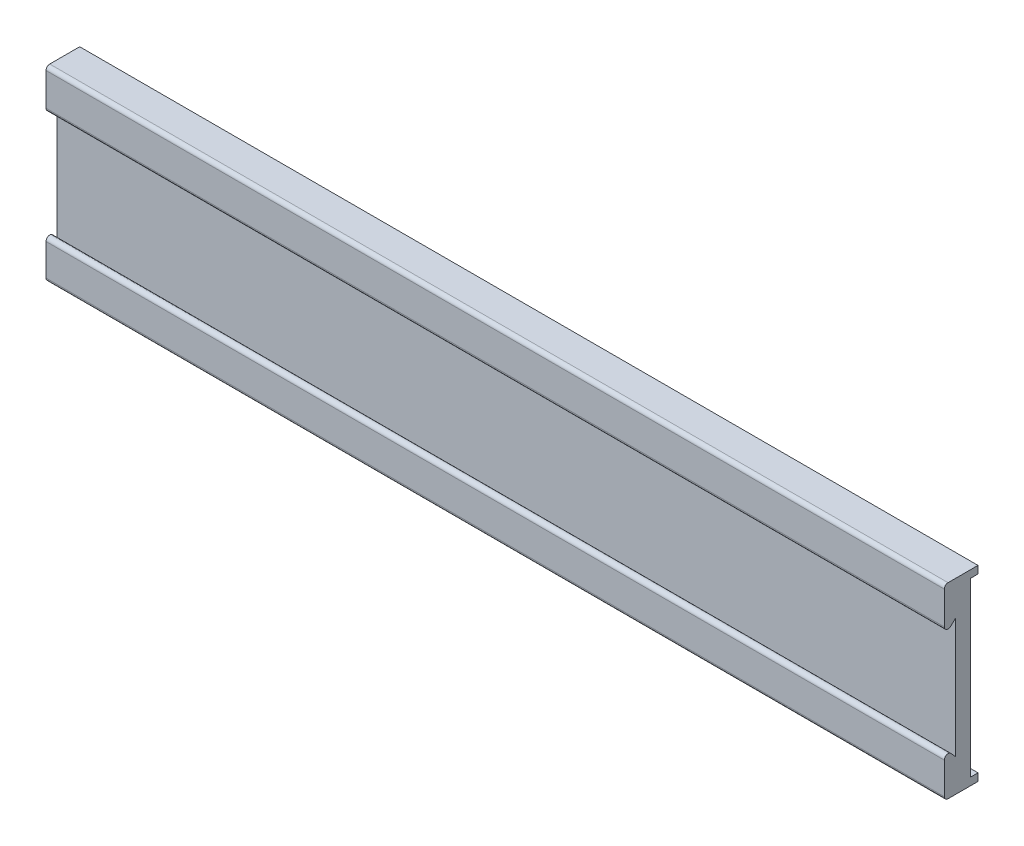
ISO-10303-21;
HEADER;
FILE_DESCRIPTION(('STEP AP214'),'2;1');
FILE_NAME('part.step','',(''),(''),'','','');
FILE_SCHEMA(('AUTOMOTIVE_DESIGN { 1 0 10303 214 1 1 1 1 }'));
ENDSEC;
DATA;
#1=APPLICATION_CONTEXT('core data for automotive mechanical design processes');
#2=APPLICATION_PROTOCOL_DEFINITION('international standard','automotive_design',2000,#1);
#3=PRODUCT_CONTEXT('',#1,'mechanical');
#4=PRODUCT('Part','Part','',(#3));
#5=PRODUCT_RELATED_PRODUCT_CATEGORY('part','',(#4));
#6=PRODUCT_DEFINITION_FORMATION('','',#4);
#7=PRODUCT_DEFINITION_CONTEXT('part definition',#1,'design');
#8=PRODUCT_DEFINITION('design','',#6,#7);
#9=PRODUCT_DEFINITION_SHAPE('','',#8);
#10=(LENGTH_UNIT() NAMED_UNIT(*) SI_UNIT(.MILLI.,.METRE.));
#11=(NAMED_UNIT(*) PLANE_ANGLE_UNIT() SI_UNIT($,.RADIAN.));
#12=(NAMED_UNIT(*) SI_UNIT($,.STERADIAN.) SOLID_ANGLE_UNIT());
#13=UNCERTAINTY_MEASURE_WITH_UNIT(LENGTH_MEASURE(1.E-05),#10,'distance_accuracy_value','');
#14=(GEOMETRIC_REPRESENTATION_CONTEXT(3) GLOBAL_UNCERTAINTY_ASSIGNED_CONTEXT((#13)) GLOBAL_UNIT_ASSIGNED_CONTEXT((#10,
#11,#12)) REPRESENTATION_CONTEXT('',''));
#15=CARTESIAN_POINT('',(0.,0.,0.));
#16=DIRECTION('',(0.,0.,1.));
#17=DIRECTION('',(1.,0.,0.));
#18=AXIS2_PLACEMENT_3D('',#15,#16,#17);
#19=CARTESIAN_POINT('',(0.,0.,3.5));
#20=DIRECTION('',(-1.,0.,0.));
#21=DIRECTION('',(0.,0.,1.));
#22=AXIS2_PLACEMENT_3D('',#19,#20,#21);
#23=PLANE('',#22);
#24=DIRECTION('',(0.,0.,-1.));
#25=VECTOR('',#24,1.);
#26=CARTESIAN_POINT('',(0.,0.,3.5));
#27=LINE('',#26,#25);
#28=CARTESIAN_POINT('',(0.,0.,3.));
#29=VERTEX_POINT('',#28);
#30=CARTESIAN_POINT('',(0.,0.,-1.));
#31=VERTEX_POINT('',#30);
#32=EDGE_CURVE('E274',#29,#31,#27,.T.);
#33=ORIENTED_EDGE('',*,*,#32,.F.);
#34=CARTESIAN_POINT('',(0.,0.5,3.));
#35=DIRECTION('',(-1.,0.,0.));
#36=DIRECTION('',(0.,0.,1.));
#37=AXIS2_PLACEMENT_3D('',#34,#35,#36);
#38=CIRCLE('',#37,0.5);
#39=CARTESIAN_POINT('',(0.,0.5,3.5));
#40=VERTEX_POINT('',#39);
#41=EDGE_CURVE('E318',#29,#40,#38,.T.);
#42=ORIENTED_EDGE('',*,*,#41,.T.);
#43=DIRECTION('',(0.,1.,0.));
#44=VECTOR('',#43,1.);
#45=CARTESIAN_POINT('',(0.,0.,3.5));
#46=LINE('',#45,#44);
#47=CARTESIAN_POINT('',(0.,4.72078886584155,3.5));
#48=VERTEX_POINT('',#47);
#49=EDGE_CURVE('E252',#40,#48,#46,.T.);
#50=ORIENTED_EDGE('',*,*,#49,.T.);
#51=CARTESIAN_POINT('',(0.,4.72078886584155,3.));
#52=DIRECTION('',(-1.,0.,0.));
#53=DIRECTION('',(0.,0.,1.));
#54=AXIS2_PLACEMENT_3D('',#51,#52,#53);
#55=CIRCLE('',#54,0.5);
#56=CARTESIAN_POINT('',(0.,5.05985373367055,2.63252889174236));
#57=VERTEX_POINT('',#56);
#58=EDGE_CURVE('E169',#48,#57,#55,.T.);
#59=ORIENTED_EDGE('',*,*,#58,.T.);
#60=DIRECTION('',(0.,-0.734942216515289,-0.678129735658003));
#61=VECTOR('',#60,1.);
#62=CARTESIAN_POINT('',(0.,1.01480803176859,-1.0998268103991));
#63=LINE('',#62,#61);
#64=CARTESIAN_POINT('',(0.,4.37433271717065,2.));
#65=VERTEX_POINT('',#64);
#66=EDGE_CURVE('E163',#57,#65,#63,.T.);
#67=ORIENTED_EDGE('',*,*,#66,.T.);
#68=DIRECTION('',(0.,-1.,0.));
#69=VECTOR('',#68,1.);
#70=CARTESIAN_POINT('',(0.,0.,2.));
#71=LINE('',#70,#69);
#72=CARTESIAN_POINT('',(0.,20.3840470456439,2.));
#73=VERTEX_POINT('',#72);
#74=EDGE_CURVE('E167',#73,#65,#71,.T.);
#75=ORIENTED_EDGE('',*,*,#74,.F.);
#76=DIRECTION('',(0.,0.678129735658003,-0.73494221651529));
#77=VECTOR('',#76,1.);
#78=CARTESIAN_POINT('',(0.,12.0070127692447,11.0788470335216));
#79=LINE('',#78,#77);
#80=CARTESIAN_POINT('',(0.,19.7742035009482,2.660935132171));
#81=VERTEX_POINT('',#80);
#82=EDGE_CURVE('E175',#81,#73,#79,.T.);
#83=ORIENTED_EDGE('',*,*,#82,.F.);
#84=CARTESIAN_POINT('',(0.,20.1416746092059,3.));
#85=DIRECTION('',(-1.,0.,0.));
#86=DIRECTION('',(0.,0.,1.));
#87=AXIS2_PLACEMENT_3D('',#84,#85,#86);
#88=CIRCLE('',#87,0.5);
#89=CARTESIAN_POINT('',(0.,20.1416746092059,3.5));
#90=VERTEX_POINT('',#89);
#91=EDGE_CURVE('E293',#81,#90,#88,.T.);
#92=ORIENTED_EDGE('',*,*,#91,.T.);
#93=CARTESIAN_POINT('',(0.,24.5,3.5));
#94=VERTEX_POINT('',#93);
#95=EDGE_CURVE('E256',#90,#94,#46,.T.);
#96=ORIENTED_EDGE('',*,*,#95,.T.);
#97=CARTESIAN_POINT('',(0.,24.5,3.));
#98=DIRECTION('',(-1.,0.,0.));
#99=DIRECTION('',(0.,0.,1.));
#100=AXIS2_PLACEMENT_3D('',#97,#98,#99);
#101=CIRCLE('',#100,0.5);
#102=CARTESIAN_POINT('',(0.,25.,3.));
#103=VERTEX_POINT('',#102);
#104=EDGE_CURVE('E66',#94,#103,#101,.T.);
#105=ORIENTED_EDGE('',*,*,#104,.T.);
#106=DIRECTION('',(0.,0.,-1.));
#107=VECTOR('',#106,1.);
#108=CARTESIAN_POINT('',(0.,25.,3.5));
#109=LINE('',#108,#107);
#110=CARTESIAN_POINT('',(0.,25.,-1.));
#111=VERTEX_POINT('',#110);
#112=EDGE_CURVE('E260',#103,#111,#109,.T.);
#113=ORIENTED_EDGE('',*,*,#112,.T.);
#114=DIRECTION('',(0.,1.,0.));
#115=VECTOR('',#114,1.);
#116=CARTESIAN_POINT('',(0.,0.,-1.));
#117=LINE('',#116,#115);
#118=CARTESIAN_POINT('',(0.,24.,-1.));
#119=VERTEX_POINT('',#118);
#120=EDGE_CURVE('E236',#119,#111,#117,.T.);
#121=ORIENTED_EDGE('',*,*,#120,.F.);
#122=DIRECTION('',(0.,0.,1.));
#123=VECTOR('',#122,1.);
#124=CARTESIAN_POINT('',(0.,24.,-1.));
#125=LINE('',#124,#123);
#126=CARTESIAN_POINT('',(0.,24.,0.));
#127=VERTEX_POINT('',#126);
#128=EDGE_CURVE('E244',#119,#127,#125,.T.);
#129=ORIENTED_EDGE('',*,*,#128,.T.);
#130=DIRECTION('',(0.,1.,0.));
#131=VECTOR('',#130,1.);
#132=CARTESIAN_POINT('',(0.,0.,0.));
#133=LINE('',#132,#131);
#134=CARTESIAN_POINT('',(0.,1.,0.));
#135=VERTEX_POINT('',#134);
#136=EDGE_CURVE('E248',#135,#127,#133,.T.);
#137=ORIENTED_EDGE('',*,*,#136,.F.);
#138=DIRECTION('',(0.,0.,1.));
#139=VECTOR('',#138,1.);
#140=CARTESIAN_POINT('',(0.,1.,-1.));
#141=LINE('',#140,#139);
#142=CARTESIAN_POINT('',(0.,1.,-1.));
#143=VERTEX_POINT('',#142);
#144=EDGE_CURVE('E212',#143,#135,#141,.T.);
#145=ORIENTED_EDGE('',*,*,#144,.F.);
#146=DIRECTION('',(0.,1.,0.));
#147=VECTOR('',#146,1.);
#148=CARTESIAN_POINT('',(0.,0.,-1.));
#149=LINE('',#148,#147);
#150=EDGE_CURVE('E201',#31,#143,#149,.T.);
#151=ORIENTED_EDGE('',*,*,#150,.F.);
#152=EDGE_LOOP('',(#33,#42,#50,#59,#67,#75,#83,#92,#96,#105,#113,#121,#129,#137,#145,#151));
#153=FACE_BOUND('',#152,.T.);
#154=ADVANCED_FACE('F50',(#153),#23,.T.);
#155=CARTESIAN_POINT('',(120.,0.,3.5));
#156=DIRECTION('',(-1.,0.,0.));
#157=DIRECTION('',(0.,0.,1.));
#158=AXIS2_PLACEMENT_3D('',#155,#156,#157);
#159=PLANE('',#158);
#160=DIRECTION('',(0.,1.,0.));
#161=VECTOR('',#160,1.);
#162=CARTESIAN_POINT('',(120.,0.,3.5));
#163=LINE('',#162,#161);
#164=CARTESIAN_POINT('',(120.,0.5,3.5));
#165=VERTEX_POINT('',#164);
#166=CARTESIAN_POINT('',(120.,4.72078886584155,3.5));
#167=VERTEX_POINT('',#166);
#168=EDGE_CURVE('E257',#165,#167,#163,.T.);
#169=ORIENTED_EDGE('',*,*,#168,.F.);
#170=CARTESIAN_POINT('',(120.,0.5,3.));
#171=DIRECTION('',(-1.,0.,0.));
#172=DIRECTION('',(0.,0.,1.));
#173=AXIS2_PLACEMENT_3D('',#170,#171,#172);
#174=CIRCLE('',#173,0.5);
#175=CARTESIAN_POINT('',(120.,0.,3.));
#176=VERTEX_POINT('',#175);
#177=EDGE_CURVE('E310',#165,#176,#174,.F.);
#178=ORIENTED_EDGE('',*,*,#177,.T.);
#179=DIRECTION('',(0.,0.,-1.));
#180=VECTOR('',#179,1.);
#181=CARTESIAN_POINT('',(120.,0.,3.5));
#182=LINE('',#181,#180);
#183=CARTESIAN_POINT('',(120.,0.,-1.));
#184=VERTEX_POINT('',#183);
#185=EDGE_CURVE('E271',#176,#184,#182,.T.);
#186=ORIENTED_EDGE('',*,*,#185,.T.);
#187=DIRECTION('',(0.,1.,0.));
#188=VECTOR('',#187,1.);
#189=CARTESIAN_POINT('',(120.,0.,-1.));
#190=LINE('',#189,#188);
#191=CARTESIAN_POINT('',(120.,1.,-1.));
#192=VERTEX_POINT('',#191);
#193=EDGE_CURVE('E208',#184,#192,#190,.T.);
#194=ORIENTED_EDGE('',*,*,#193,.T.);
#195=DIRECTION('',(0.,0.,1.));
#196=VECTOR('',#195,1.);
#197=CARTESIAN_POINT('',(120.,1.,-1.));
#198=LINE('',#197,#196);
#199=CARTESIAN_POINT('',(120.,1.,0.));
#200=VERTEX_POINT('',#199);
#201=EDGE_CURVE('E216',#192,#200,#198,.T.);
#202=ORIENTED_EDGE('',*,*,#201,.T.);
#203=DIRECTION('',(0.,1.,0.));
#204=VECTOR('',#203,1.);
#205=CARTESIAN_POINT('',(120.,0.,0.));
#206=LINE('',#205,#204);
#207=CARTESIAN_POINT('',(120.,24.,0.));
#208=VERTEX_POINT('',#207);
#209=EDGE_CURVE('E263',#200,#208,#206,.T.);
#210=ORIENTED_EDGE('',*,*,#209,.T.);
#211=DIRECTION('',(0.,0.,1.));
#212=VECTOR('',#211,1.);
#213=CARTESIAN_POINT('',(120.,24.,-1.));
#214=LINE('',#213,#212);
#215=CARTESIAN_POINT('',(120.,24.,-1.));
#216=VERTEX_POINT('',#215);
#217=EDGE_CURVE('E240',#216,#208,#214,.T.);
#218=ORIENTED_EDGE('',*,*,#217,.F.);
#219=DIRECTION('',(0.,1.,0.));
#220=VECTOR('',#219,1.);
#221=CARTESIAN_POINT('',(120.,0.,-1.));
#222=LINE('',#221,#220);
#223=CARTESIAN_POINT('',(120.,25.,-1.));
#224=VERTEX_POINT('',#223);
#225=EDGE_CURVE('E228',#216,#224,#222,.T.);
#226=ORIENTED_EDGE('',*,*,#225,.T.);
#227=DIRECTION('',(0.,0.,-1.));
#228=VECTOR('',#227,1.);
#229=CARTESIAN_POINT('',(120.,25.,3.5));
#230=LINE('',#229,#228);
#231=CARTESIAN_POINT('',(120.,25.,3.));
#232=VERTEX_POINT('',#231);
#233=EDGE_CURVE('E268',#232,#224,#230,.T.);
#234=ORIENTED_EDGE('',*,*,#233,.F.);
#235=CARTESIAN_POINT('',(120.,24.5,3.));
#236=DIRECTION('',(-1.,0.,0.));
#237=DIRECTION('',(0.,0.,1.));
#238=AXIS2_PLACEMENT_3D('',#235,#236,#237);
#239=CIRCLE('',#238,0.5);
#240=CARTESIAN_POINT('',(120.,24.5,3.5));
#241=VERTEX_POINT('',#240);
#242=EDGE_CURVE('E307',#232,#241,#239,.F.);
#243=ORIENTED_EDGE('',*,*,#242,.T.);
#244=CARTESIAN_POINT('',(120.,20.1416746092059,3.5));
#245=VERTEX_POINT('',#244);
#246=EDGE_CURVE('E255',#245,#241,#163,.T.);
#247=ORIENTED_EDGE('',*,*,#246,.F.);
#248=CARTESIAN_POINT('',(120.,20.1416746092059,3.));
#249=DIRECTION('',(-1.,0.,0.));
#250=DIRECTION('',(0.,0.,1.));
#251=AXIS2_PLACEMENT_3D('',#248,#249,#250);
#252=CIRCLE('',#251,0.5);
#253=CARTESIAN_POINT('',(120.,19.7742035009482,2.660935132171));
#254=VERTEX_POINT('',#253);
#255=EDGE_CURVE('E285',#245,#254,#252,.F.);
#256=ORIENTED_EDGE('',*,*,#255,.T.);
#257=DIRECTION('',(0.,0.678129735658003,-0.73494221651529));
#258=VECTOR('',#257,1.);
#259=CARTESIAN_POINT('',(120.,12.0070127692447,11.0788470335216));
#260=LINE('',#259,#258);
#261=CARTESIAN_POINT('',(120.,20.3840470456439,2.));
#262=VERTEX_POINT('',#261);
#263=EDGE_CURVE('E544',#254,#262,#260,.T.);
#264=ORIENTED_EDGE('',*,*,#263,.T.);
#265=DIRECTION('',(0.,-1.,0.));
#266=VECTOR('',#265,1.);
#267=CARTESIAN_POINT('',(120.,0.,2.));
#268=LINE('',#267,#266);
#269=CARTESIAN_POINT('',(120.,4.37433271717065,2.));
#270=VERTEX_POINT('',#269);
#271=EDGE_CURVE('E548',#262,#270,#268,.T.);
#272=ORIENTED_EDGE('',*,*,#271,.T.);
#273=DIRECTION('',(0.,-0.734942216515289,-0.678129735658003));
#274=VECTOR('',#273,1.);
#275=CARTESIAN_POINT('',(120.,1.01480803176859,-1.0998268103991));
#276=LINE('',#275,#274);
#277=CARTESIAN_POINT('',(120.,5.05985373367055,2.63252889174236));
#278=VERTEX_POINT('',#277);
#279=EDGE_CURVE('E190',#278,#270,#276,.T.);
#280=ORIENTED_EDGE('',*,*,#279,.F.);
#281=CARTESIAN_POINT('',(120.,4.72078886584155,3.));
#282=DIRECTION('',(-1.,0.,0.));
#283=DIRECTION('',(0.,0.,1.));
#284=AXIS2_PLACEMENT_3D('',#281,#282,#283);
#285=CIRCLE('',#284,0.5);
#286=EDGE_CURVE('E281',#278,#167,#285,.F.);
#287=ORIENTED_EDGE('',*,*,#286,.T.);
#288=EDGE_LOOP('',(#169,#178,#186,#194,#202,#210,#218,#226,#234,#243,#247,#256,#264,#272,#280,#287));
#289=FACE_BOUND('',#288,.T.);
#290=ADVANCED_FACE('F330',(#289),#159,.F.);
#291=CARTESIAN_POINT('',(0.,0.,3.5));
#292=DIRECTION('',(0.,0.,1.));
#293=DIRECTION('',(1.,0.,0.));
#294=AXIS2_PLACEMENT_3D('',#291,#292,#293);
#295=PLANE('',#294);
#296=ORIENTED_EDGE('',*,*,#246,.T.);
#297=DIRECTION('',(1.,0.,0.));
#298=VECTOR('',#297,1.);
#299=CARTESIAN_POINT('',(0.,24.5,3.5));
#300=LINE('',#299,#298);
#301=EDGE_CURVE('E13',#241,#94,#300,.F.);
#302=ORIENTED_EDGE('',*,*,#301,.T.);
#303=ORIENTED_EDGE('',*,*,#95,.F.);
#304=DIRECTION('',(1.,0.,0.));
#305=VECTOR('',#304,1.);
#306=CARTESIAN_POINT('',(0.,20.1416746092059,3.5));
#307=LINE('',#306,#305);
#308=EDGE_CURVE('E277',#90,#245,#307,.T.);
#309=ORIENTED_EDGE('',*,*,#308,.T.);
#310=EDGE_LOOP('',(#296,#302,#303,#309));
#311=FACE_BOUND('',#310,.T.);
#312=ADVANCED_FACE('F380',(#311),#295,.T.);
#313=CARTESIAN_POINT('',(0.,0.,0.));
#314=DIRECTION('',(0.,0.,1.));
#315=DIRECTION('',(1.,0.,0.));
#316=AXIS2_PLACEMENT_3D('',#313,#314,#315);
#317=PLANE('',#316);
#318=DIRECTION('',(1.,0.,0.));
#319=VECTOR('',#318,1.);
#320=CARTESIAN_POINT('',(0.,1.,0.));
#321=LINE('',#320,#319);
#322=EDGE_CURVE('E194',#135,#200,#321,.T.);
#323=ORIENTED_EDGE('',*,*,#322,.F.);
#324=ORIENTED_EDGE('',*,*,#136,.T.);
#325=DIRECTION('',(1.,0.,0.));
#326=VECTOR('',#325,1.);
#327=CARTESIAN_POINT('',(0.,24.,0.));
#328=LINE('',#327,#326);
#329=EDGE_CURVE('E220',#127,#208,#328,.T.);
#330=ORIENTED_EDGE('',*,*,#329,.T.);
#331=ORIENTED_EDGE('',*,*,#209,.F.);
#332=EDGE_LOOP('',(#323,#324,#330,#331));
#333=FACE_BOUND('',#332,.T.);
#334=ADVANCED_FACE('F345',(#333),#317,.F.);
#335=CARTESIAN_POINT('',(0.,0.,3.5));
#336=DIRECTION('',(0.,1.,0.));
#337=DIRECTION('',(0.,0.,1.));
#338=AXIS2_PLACEMENT_3D('',#335,#336,#337);
#339=PLANE('',#338);
#340=ORIENTED_EDGE('',*,*,#185,.F.);
#341=DIRECTION('',(1.,0.,0.));
#342=VECTOR('',#341,1.);
#343=CARTESIAN_POINT('',(0.,0.,3.));
#344=LINE('',#343,#342);
#345=EDGE_CURVE('E313',#176,#29,#344,.F.);
#346=ORIENTED_EDGE('',*,*,#345,.T.);
#347=ORIENTED_EDGE('',*,*,#32,.T.);
#348=DIRECTION('',(1.,0.,0.));
#349=VECTOR('',#348,1.);
#350=CARTESIAN_POINT('',(0.,0.,-1.));
#351=LINE('',#350,#349);
#352=EDGE_CURVE('E204',#31,#184,#351,.T.);
#353=ORIENTED_EDGE('',*,*,#352,.T.);
#354=EDGE_LOOP('',(#340,#346,#347,#353));
#355=FACE_BOUND('',#354,.T.);
#356=ADVANCED_FACE('F383',(#355),#339,.F.);
#357=CARTESIAN_POINT('',(0.,25.,3.5));
#358=DIRECTION('',(0.,1.,0.));
#359=DIRECTION('',(0.,0.,1.));
#360=AXIS2_PLACEMENT_3D('',#357,#358,#359);
#361=PLANE('',#360);
#362=ORIENTED_EDGE('',*,*,#112,.F.);
#363=DIRECTION('',(1.,0.,0.));
#364=VECTOR('',#363,1.);
#365=CARTESIAN_POINT('',(0.,25.,3.));
#366=LINE('',#365,#364);
#367=EDGE_CURVE('E59',#103,#232,#366,.T.);
#368=ORIENTED_EDGE('',*,*,#367,.T.);
#369=ORIENTED_EDGE('',*,*,#233,.T.);
#370=DIRECTION('',(1.,0.,0.));
#371=VECTOR('',#370,1.);
#372=CARTESIAN_POINT('',(0.,25.,-1.));
#373=LINE('',#372,#371);
#374=EDGE_CURVE('E232',#111,#224,#373,.T.);
#375=ORIENTED_EDGE('',*,*,#374,.F.);
#376=EDGE_LOOP('',(#362,#368,#369,#375));
#377=FACE_BOUND('',#376,.T.);
#378=ADVANCED_FACE('F325',(#377),#361,.T.);
#379=ORIENTED_EDGE('',*,*,#49,.F.);
#380=DIRECTION('',(1.,0.,0.));
#381=VECTOR('',#380,1.);
#382=CARTESIAN_POINT('',(120.,0.5,3.5));
#383=LINE('',#382,#381);
#384=EDGE_CURVE('E303',#40,#165,#383,.T.);
#385=ORIENTED_EDGE('',*,*,#384,.T.);
#386=ORIENTED_EDGE('',*,*,#168,.T.);
#387=DIRECTION('',(1.,0.,0.));
#388=VECTOR('',#387,1.);
#389=CARTESIAN_POINT('',(0.,4.72078886584155,3.5));
#390=LINE('',#389,#388);
#391=EDGE_CURVE('E299',#167,#48,#390,.F.);
#392=ORIENTED_EDGE('',*,*,#391,.T.);
#393=EDGE_LOOP('',(#379,#385,#386,#392));
#394=FACE_BOUND('',#393,.T.);
#395=ADVANCED_FACE('F361',(#394),#295,.T.);
#396=CARTESIAN_POINT('',(0.,24.,-1.));
#397=DIRECTION('',(0.,-1.,0.));
#398=DIRECTION('',(0.,0.,-1.));
#399=AXIS2_PLACEMENT_3D('',#396,#397,#398);
#400=PLANE('',#399);
#401=ORIENTED_EDGE('',*,*,#329,.F.);
#402=ORIENTED_EDGE('',*,*,#128,.F.);
#403=DIRECTION('',(1.,0.,0.));
#404=VECTOR('',#403,1.);
#405=CARTESIAN_POINT('',(0.,24.,-1.));
#406=LINE('',#405,#404);
#407=EDGE_CURVE('E224',#119,#216,#406,.T.);
#408=ORIENTED_EDGE('',*,*,#407,.T.);
#409=ORIENTED_EDGE('',*,*,#217,.T.);
#410=EDGE_LOOP('',(#401,#402,#408,#409));
#411=FACE_BOUND('',#410,.T.);
#412=ADVANCED_FACE('F338',(#411),#400,.T.);
#413=CARTESIAN_POINT('',(0.,0.,-1.));
#414=DIRECTION('',(0.,0.,1.));
#415=DIRECTION('',(1.,0.,0.));
#416=AXIS2_PLACEMENT_3D('',#413,#414,#415);
#417=PLANE('',#416);
#418=ORIENTED_EDGE('',*,*,#407,.F.);
#419=ORIENTED_EDGE('',*,*,#120,.T.);
#420=ORIENTED_EDGE('',*,*,#374,.T.);
#421=ORIENTED_EDGE('',*,*,#225,.F.);
#422=EDGE_LOOP('',(#418,#419,#420,#421));
#423=FACE_BOUND('',#422,.T.);
#424=ADVANCED_FACE('F335',(#423),#417,.F.);
#425=CARTESIAN_POINT('',(0.,1.,-1.));
#426=DIRECTION('',(0.,-1.,0.));
#427=DIRECTION('',(0.,0.,-1.));
#428=AXIS2_PLACEMENT_3D('',#425,#426,#427);
#429=PLANE('',#428);
#430=ORIENTED_EDGE('',*,*,#322,.T.);
#431=ORIENTED_EDGE('',*,*,#201,.F.);
#432=DIRECTION('',(1.,0.,0.));
#433=VECTOR('',#432,1.);
#434=CARTESIAN_POINT('',(0.,1.,-1.));
#435=LINE('',#434,#433);
#436=EDGE_CURVE('E198',#143,#192,#435,.T.);
#437=ORIENTED_EDGE('',*,*,#436,.F.);
#438=ORIENTED_EDGE('',*,*,#144,.T.);
#439=EDGE_LOOP('',(#430,#431,#437,#438));
#440=FACE_BOUND('',#439,.T.);
#441=ADVANCED_FACE('F348',(#440),#429,.F.);
#442=CARTESIAN_POINT('',(0.,0.,-1.));
#443=DIRECTION('',(0.,0.,1.));
#444=DIRECTION('',(1.,0.,0.));
#445=AXIS2_PLACEMENT_3D('',#442,#443,#444);
#446=PLANE('',#445);
#447=ORIENTED_EDGE('',*,*,#436,.T.);
#448=ORIENTED_EDGE('',*,*,#193,.F.);
#449=ORIENTED_EDGE('',*,*,#352,.F.);
#450=ORIENTED_EDGE('',*,*,#150,.T.);
#451=EDGE_LOOP('',(#447,#448,#449,#450));
#452=FACE_BOUND('',#451,.T.);
#453=ADVANCED_FACE('F351',(#452),#446,.F.);
#454=CARTESIAN_POINT('',(0.,12.0070127692447,11.0788470335216));
#455=DIRECTION('',(0.,-0.73494221651529,-0.678129735658003));
#456=DIRECTION('',(0.,0.678129735658003,-0.73494221651529));
#457=AXIS2_PLACEMENT_3D('',#454,#455,#456);
#458=PLANE('',#457);
#459=ORIENTED_EDGE('',*,*,#263,.F.);
#460=DIRECTION('',(1.,0.,0.));
#461=VECTOR('',#460,1.);
#462=CARTESIAN_POINT('',(0.,19.7742035009482,2.660935132171));
#463=LINE('',#462,#461);
#464=EDGE_CURVE('E288',#254,#81,#463,.F.);
#465=ORIENTED_EDGE('',*,*,#464,.T.);
#466=ORIENTED_EDGE('',*,*,#82,.T.);
#467=DIRECTION('',(1.,0.,0.));
#468=VECTOR('',#467,1.);
#469=CARTESIAN_POINT('',(0.,20.3840470456439,2.));
#470=LINE('',#469,#468);
#471=EDGE_CURVE('E185',#73,#262,#470,.T.);
#472=ORIENTED_EDGE('',*,*,#471,.T.);
#473=EDGE_LOOP('',(#459,#465,#466,#472));
#474=FACE_BOUND('',#473,.T.);
#475=ADVANCED_FACE('F400',(#474),#458,.T.);
#476=CARTESIAN_POINT('',(0.,0.,2.));
#477=DIRECTION('',(0.,0.,1.));
#478=DIRECTION('',(1.,0.,0.));
#479=AXIS2_PLACEMENT_3D('',#476,#477,#478);
#480=PLANE('',#479);
#481=ORIENTED_EDGE('',*,*,#271,.F.);
#482=ORIENTED_EDGE('',*,*,#471,.F.);
#483=ORIENTED_EDGE('',*,*,#74,.T.);
#484=DIRECTION('',(1.,0.,0.));
#485=VECTOR('',#484,1.);
#486=CARTESIAN_POINT('',(0.,4.37433271717065,2.));
#487=LINE('',#486,#485);
#488=EDGE_CURVE('E182',#65,#270,#487,.T.);
#489=ORIENTED_EDGE('',*,*,#488,.T.);
#490=EDGE_LOOP('',(#481,#482,#483,#489));
#491=FACE_BOUND('',#490,.T.);
#492=ADVANCED_FACE('F181',(#491),#480,.T.);
#493=CARTESIAN_POINT('',(0.,1.01480803176859,-1.0998268103991));
#494=DIRECTION('',(0.,-0.678129735658003,0.734942216515289));
#495=DIRECTION('',(0.,-0.734942216515289,-0.678129735658003));
#496=AXIS2_PLACEMENT_3D('',#493,#494,#495);
#497=PLANE('',#496);
#498=ORIENTED_EDGE('',*,*,#66,.F.);
#499=DIRECTION('',(1.,0.,0.));
#500=VECTOR('',#499,1.);
#501=CARTESIAN_POINT('',(120.,5.05985373367055,2.63252889174236));
#502=LINE('',#501,#500);
#503=EDGE_CURVE('E296',#57,#278,#502,.T.);
#504=ORIENTED_EDGE('',*,*,#503,.T.);
#505=ORIENTED_EDGE('',*,*,#279,.T.);
#506=ORIENTED_EDGE('',*,*,#488,.F.);
#507=EDGE_LOOP('',(#498,#504,#505,#506));
#508=FACE_BOUND('',#507,.T.);
#509=ADVANCED_FACE('F188',(#508),#497,.F.);
#510=CARTESIAN_POINT('',(0.,20.1416746092059,3.));
#511=DIRECTION('',(1.,0.,0.));
#512=DIRECTION('',(0.,0.,-1.));
#513=AXIS2_PLACEMENT_3D('',#510,#511,#512);
#514=CYLINDRICAL_SURFACE('',#513,0.5);
#515=ORIENTED_EDGE('',*,*,#91,.F.);
#516=ORIENTED_EDGE('',*,*,#464,.F.);
#517=ORIENTED_EDGE('',*,*,#255,.F.);
#518=ORIENTED_EDGE('',*,*,#308,.F.);
#519=EDGE_LOOP('',(#515,#516,#517,#518));
#520=FACE_BOUND('',#519,.T.);
#521=ADVANCED_FACE('F367',(#520),#514,.T.);
#522=CARTESIAN_POINT('',(0.,4.72078886584155,3.));
#523=DIRECTION('',(-1.,0.,0.));
#524=DIRECTION('',(0.,0.,1.));
#525=AXIS2_PLACEMENT_3D('',#522,#523,#524);
#526=CYLINDRICAL_SURFACE('',#525,0.5);
#527=ORIENTED_EDGE('',*,*,#58,.F.);
#528=ORIENTED_EDGE('',*,*,#391,.F.);
#529=ORIENTED_EDGE('',*,*,#286,.F.);
#530=ORIENTED_EDGE('',*,*,#503,.F.);
#531=EDGE_LOOP('',(#527,#528,#529,#530));
#532=FACE_BOUND('',#531,.T.);
#533=ADVANCED_FACE('F365',(#532),#526,.T.);
#534=CARTESIAN_POINT('',(0.,0.5,3.));
#535=DIRECTION('',(-1.,0.,0.));
#536=DIRECTION('',(0.,0.,1.));
#537=AXIS2_PLACEMENT_3D('',#534,#535,#536);
#538=CYLINDRICAL_SURFACE('',#537,0.5);
#539=ORIENTED_EDGE('',*,*,#41,.F.);
#540=ORIENTED_EDGE('',*,*,#345,.F.);
#541=ORIENTED_EDGE('',*,*,#177,.F.);
#542=ORIENTED_EDGE('',*,*,#384,.F.);
#543=EDGE_LOOP('',(#539,#540,#541,#542));
#544=FACE_BOUND('',#543,.T.);
#545=ADVANCED_FACE('F359',(#544),#538,.T.);
#546=CARTESIAN_POINT('',(0.,24.5,3.));
#547=DIRECTION('',(1.,0.,0.));
#548=DIRECTION('',(0.,0.,-1.));
#549=AXIS2_PLACEMENT_3D('',#546,#547,#548);
#550=CYLINDRICAL_SURFACE('',#549,0.5);
#551=ORIENTED_EDGE('',*,*,#104,.F.);
#552=ORIENTED_EDGE('',*,*,#301,.F.);
#553=ORIENTED_EDGE('',*,*,#242,.F.);
#554=ORIENTED_EDGE('',*,*,#367,.F.);
#555=EDGE_LOOP('',(#551,#552,#553,#554));
#556=FACE_BOUND('',#555,.T.);
#557=ADVANCED_FACE('F52',(#556),#550,.T.);
#558=CLOSED_SHELL('',(#154,#290,#312,#334,#356,#378,#395,#412,#424,#441,#453,#475,#492,#509,
#521,#533,#545,#557));
#559=MANIFOLD_SOLID_BREP('B2',#558);
#560=ADVANCED_BREP_SHAPE_REPRESENTATION('',(#18,#559),#14);
#561=SHAPE_DEFINITION_REPRESENTATION(#9,#560);
ENDSEC;
END-ISO-10303-21;
